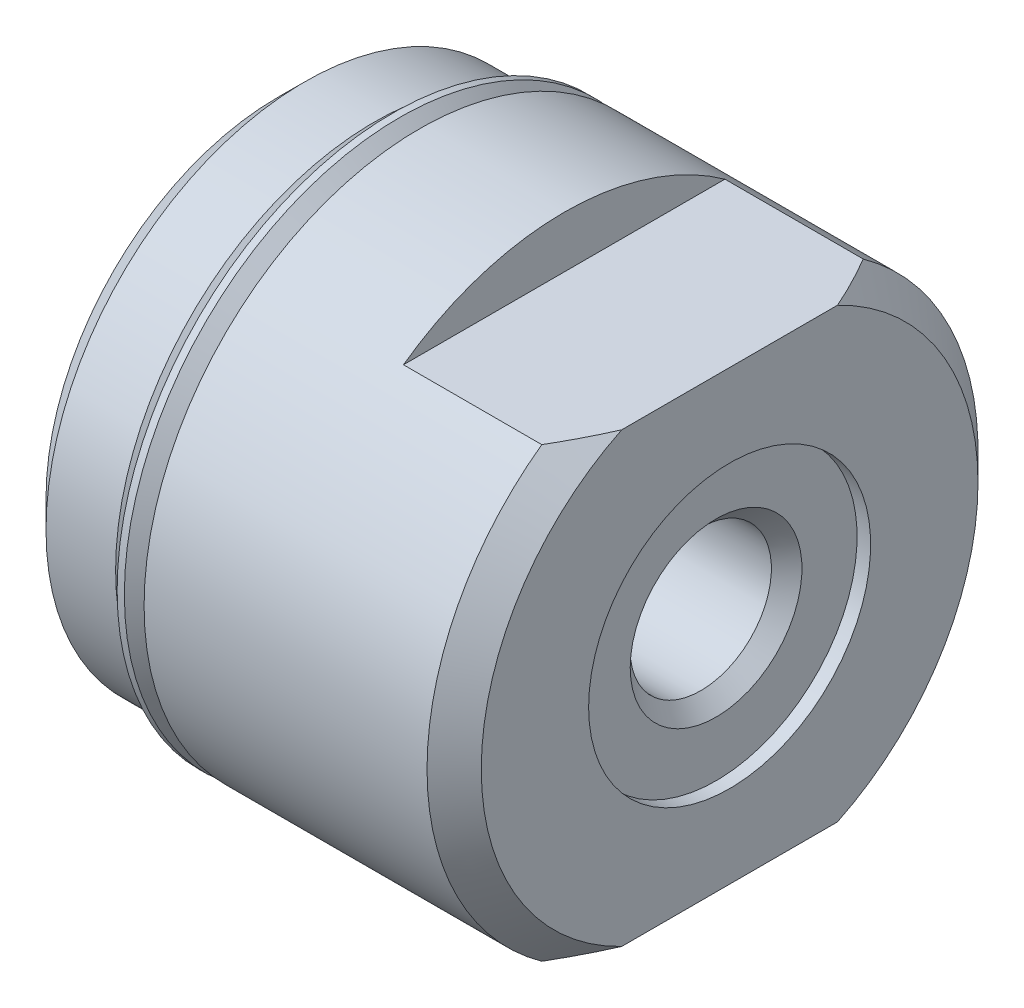
ISO-10303-21;
HEADER;
FILE_DESCRIPTION(('STEP AP214'),'2;1');
FILE_NAME('part.step','',(''),(''),'','','');
FILE_SCHEMA(('AUTOMOTIVE_DESIGN { 1 0 10303 214 1 1 1 1 }'));
ENDSEC;
DATA;
#1=APPLICATION_CONTEXT('core data for automotive mechanical design processes');
#2=APPLICATION_PROTOCOL_DEFINITION('international standard','automotive_design',2000,#1);
#3=PRODUCT_CONTEXT('',#1,'mechanical');
#4=PRODUCT('Part','Part','',(#3));
#5=PRODUCT_RELATED_PRODUCT_CATEGORY('part','',(#4));
#6=PRODUCT_DEFINITION_FORMATION('','',#4);
#7=PRODUCT_DEFINITION_CONTEXT('part definition',#1,'design');
#8=PRODUCT_DEFINITION('design','',#6,#7);
#9=PRODUCT_DEFINITION_SHAPE('','',#8);
#10=(LENGTH_UNIT() NAMED_UNIT(*) SI_UNIT(.MILLI.,.METRE.));
#11=(NAMED_UNIT(*) PLANE_ANGLE_UNIT() SI_UNIT($,.RADIAN.));
#12=(NAMED_UNIT(*) SI_UNIT($,.STERADIAN.) SOLID_ANGLE_UNIT());
#13=UNCERTAINTY_MEASURE_WITH_UNIT(LENGTH_MEASURE(1.E-05),#10,'distance_accuracy_value','');
#14=(GEOMETRIC_REPRESENTATION_CONTEXT(3) GLOBAL_UNCERTAINTY_ASSIGNED_CONTEXT((#13)) GLOBAL_UNIT_ASSIGNED_CONTEXT((#10,
#11,#12)) REPRESENTATION_CONTEXT('',''));
#15=CARTESIAN_POINT('',(0.,0.,0.));
#16=DIRECTION('',(0.,0.,1.));
#17=DIRECTION('',(1.,0.,0.));
#18=AXIS2_PLACEMENT_3D('',#15,#16,#17);
#19=CARTESIAN_POINT('',(12.7,0.,0.));
#20=DIRECTION('',(-1.,0.,0.));
#21=DIRECTION('',(0.,0.,1.));
#22=AXIS2_PLACEMENT_3D('',#19,#20,#21);
#23=CYLINDRICAL_SURFACE('',#22,6.63575);
#24=CARTESIAN_POINT('',(3.3528,0.,0.));
#25=DIRECTION('',(-1.,0.,0.));
#26=DIRECTION('',(0.,0.,1.));
#27=AXIS2_PLACEMENT_3D('',#24,#25,#26);
#28=CIRCLE('',#27,6.63575);
#29=CARTESIAN_POINT('',(3.3528,0.,6.63575));
#30=VERTEX_POINT('',#29);
#31=EDGE_CURVE('E123',#30,#30,#28,.T.);
#32=ORIENTED_EDGE('',*,*,#31,.F.);
#33=EDGE_LOOP('',(#32));
#34=FACE_BOUND('',#33,.T.);
#35=CARTESIAN_POINT('',(3.6703,0.,0.));
#36=DIRECTION('',(1.,0.,0.));
#37=DIRECTION('',(0.,0.,-1.));
#38=AXIS2_PLACEMENT_3D('',#35,#36,#37);
#39=CIRCLE('',#38,6.63575);
#40=CARTESIAN_POINT('',(3.6703,0.,-6.63575));
#41=VERTEX_POINT('',#40);
#42=EDGE_CURVE('E11',#41,#41,#39,.T.);
#43=ORIENTED_EDGE('',*,*,#42,.F.);
#44=EDGE_LOOP('',(#43));
#45=FACE_BOUND('',#44,.T.);
#46=ADVANCED_FACE('F38',(#34,#45),#23,.T.);
#47=CARTESIAN_POINT('',(3.9878,6.63575,0.));
#48=DIRECTION('',(1.,0.,0.));
#49=DIRECTION('',(0.,0.,-1.));
#50=AXIS2_PLACEMENT_3D('',#47,#48,#49);
#51=PLANE('',#50);
#52=CARTESIAN_POINT('',(3.9878,0.,0.));
#53=DIRECTION('',(-1.,0.,0.));
#54=DIRECTION('',(0.,0.,1.));
#55=AXIS2_PLACEMENT_3D('',#52,#53,#54);
#56=CIRCLE('',#55,7.74065);
#57=CARTESIAN_POINT('',(3.9878,0.,7.74065));
#58=VERTEX_POINT('',#57);
#59=EDGE_CURVE('E120',#58,#58,#56,.T.);
#60=ORIENTED_EDGE('',*,*,#59,.T.);
#61=EDGE_LOOP('',(#60));
#62=FACE_BOUND('',#61,.T.);
#63=CARTESIAN_POINT('',(3.9878,0.,0.));
#64=DIRECTION('',(1.,0.,0.));
#65=DIRECTION('',(0.,0.,-1.));
#66=AXIS2_PLACEMENT_3D('',#63,#64,#65);
#67=CIRCLE('',#66,7.1861438079811);
#68=CARTESIAN_POINT('',(3.9878,0.,-7.1861438079811));
#69=VERTEX_POINT('',#68);
#70=EDGE_CURVE('E46',#69,#69,#67,.F.);
#71=ORIENTED_EDGE('',*,*,#70,.F.);
#72=EDGE_LOOP('',(#71));
#73=FACE_BOUND('',#72,.T.);
#74=ADVANCED_FACE('F179',(#62,#73),#51,.F.);
#75=CARTESIAN_POINT('',(12.7,6.97865,0.));
#76=DIRECTION('',(-1.,0.,0.));
#77=DIRECTION('',(0.,0.,1.));
#78=AXIS2_PLACEMENT_3D('',#75,#76,#77);
#79=PLANE('',#78);
#80=CARTESIAN_POINT('',(12.7,0.,0.));
#81=DIRECTION('',(-1.,0.,0.));
#82=DIRECTION('',(0.,0.,1.));
#83=AXIS2_PLACEMENT_3D('',#80,#81,#82);
#84=CIRCLE('',#83,3.9624);
#85=CARTESIAN_POINT('',(12.7,0.,3.9624));
#86=VERTEX_POINT('',#85);
#87=EDGE_CURVE('E219',#86,#86,#84,.T.);
#88=ORIENTED_EDGE('',*,*,#87,.T.);
#89=EDGE_LOOP('',(#88));
#90=FACE_BOUND('',#89,.T.);
#91=DIRECTION('',(0.,0.,1.));
#92=VECTOR('',#91,1.);
#93=CARTESIAN_POINT('',(12.7,6.2865,-15.4813));
#94=LINE('',#93,#92);
#95=CARTESIAN_POINT('',(12.7,6.2865,-3.03009464744915));
#96=VERTEX_POINT('',#95);
#97=CARTESIAN_POINT('',(12.7,6.2865,3.03009464744915));
#98=VERTEX_POINT('',#97);
#99=EDGE_CURVE('E61',#96,#98,#94,.T.);
#100=ORIENTED_EDGE('',*,*,#99,.T.);
#101=CARTESIAN_POINT('',(12.7,0.,0.));
#102=DIRECTION('',(-1.,0.,0.));
#103=DIRECTION('',(0.,0.,1.));
#104=AXIS2_PLACEMENT_3D('',#101,#102,#103);
#105=CIRCLE('',#104,6.97865);
#106=CARTESIAN_POINT('',(12.7,-6.2865,3.03009464744915));
#107=VERTEX_POINT('',#106);
#108=EDGE_CURVE('E107',#107,#98,#105,.T.);
#109=ORIENTED_EDGE('',*,*,#108,.F.);
#110=DIRECTION('',(0.,0.,-1.));
#111=VECTOR('',#110,1.);
#112=CARTESIAN_POINT('',(12.7,-6.2865,15.4813));
#113=LINE('',#112,#111);
#114=CARTESIAN_POINT('',(12.7,-6.2865,-3.03009464744915));
#115=VERTEX_POINT('',#114);
#116=EDGE_CURVE('E53',#107,#115,#113,.T.);
#117=ORIENTED_EDGE('',*,*,#116,.T.);
#118=EDGE_CURVE('E105',#96,#115,#105,.T.);
#119=ORIENTED_EDGE('',*,*,#118,.F.);
#120=EDGE_LOOP('',(#100,#109,#117,#119));
#121=FACE_BOUND('',#120,.T.);
#122=ADVANCED_FACE('F104',(#90,#121),#79,.F.);
#123=CARTESIAN_POINT('',(12.7,0.,0.));
#124=DIRECTION('',(-1.,0.,0.));
#125=DIRECTION('',(0.,0.,1.));
#126=AXIS2_PLACEMENT_3D('',#123,#124,#125);
#127=CYLINDRICAL_SURFACE('',#126,7.74065);
#128=ORIENTED_EDGE('',*,*,#59,.F.);
#129=EDGE_LOOP('',(#128));
#130=FACE_BOUND('',#129,.T.);
#131=DIRECTION('',(-1.,0.,0.));
#132=VECTOR('',#131,1.);
#133=CARTESIAN_POINT('',(12.7,6.2865,-4.51636802890331));
#134=LINE('',#133,#132);
#135=CARTESIAN_POINT('',(11.938,6.2865,-4.51636802890331));
#136=VERTEX_POINT('',#135);
#137=CARTESIAN_POINT('',(8.0518,6.2865,-4.51636802890331));
#138=VERTEX_POINT('',#137);
#139=EDGE_CURVE('E230',#136,#138,#134,.T.);
#140=ORIENTED_EDGE('',*,*,#139,.F.);
#141=CARTESIAN_POINT('',(11.938,0.,0.));
#142=DIRECTION('',(-1.,0.,0.));
#143=DIRECTION('',(0.,0.,1.));
#144=AXIS2_PLACEMENT_3D('',#141,#142,#143);
#145=CIRCLE('',#144,7.74065);
#146=CARTESIAN_POINT('',(11.938,-6.2865,-4.51636802890336));
#147=VERTEX_POINT('',#146);
#148=EDGE_CURVE('E114',#136,#147,#145,.T.);
#149=ORIENTED_EDGE('',*,*,#148,.T.);
#150=DIRECTION('',(-1.,0.,0.));
#151=VECTOR('',#150,1.);
#152=CARTESIAN_POINT('',(12.7,-6.2865,-4.51636802890331));
#153=LINE('',#152,#151);
#154=CARTESIAN_POINT('',(8.0518,-6.2865,-4.51636802890331));
#155=VERTEX_POINT('',#154);
#156=EDGE_CURVE('E93',#155,#147,#153,.F.);
#157=ORIENTED_EDGE('',*,*,#156,.F.);
#158=CARTESIAN_POINT('',(8.0518,0.,0.));
#159=DIRECTION('',(1.,0.,0.));
#160=DIRECTION('',(0.,0.,-1.));
#161=AXIS2_PLACEMENT_3D('',#158,#159,#160);
#162=CIRCLE('',#161,7.74065);
#163=CARTESIAN_POINT('',(8.0518,-6.2865,4.51636802890331));
#164=VERTEX_POINT('',#163);
#165=EDGE_CURVE('E272',#164,#155,#162,.T.);
#166=ORIENTED_EDGE('',*,*,#165,.F.);
#167=DIRECTION('',(-1.,0.,0.));
#168=VECTOR('',#167,1.);
#169=CARTESIAN_POINT('',(12.7,-6.2865,4.51636802890331));
#170=LINE('',#169,#168);
#171=CARTESIAN_POINT('',(11.938,-6.2865,4.51636802890331));
#172=VERTEX_POINT('',#171);
#173=EDGE_CURVE('E233',#172,#164,#170,.T.);
#174=ORIENTED_EDGE('',*,*,#173,.F.);
#175=CARTESIAN_POINT('',(11.938,6.2865,4.51636802890336));
#176=VERTEX_POINT('',#175);
#177=EDGE_CURVE('E111',#172,#176,#145,.T.);
#178=ORIENTED_EDGE('',*,*,#177,.T.);
#179=DIRECTION('',(-1.,0.,0.));
#180=VECTOR('',#179,1.);
#181=CARTESIAN_POINT('',(12.7,6.2865,4.51636802890331));
#182=LINE('',#181,#180);
#183=CARTESIAN_POINT('',(8.0518,6.2865,4.51636802890331));
#184=VERTEX_POINT('',#183);
#185=EDGE_CURVE('E228',#184,#176,#182,.F.);
#186=ORIENTED_EDGE('',*,*,#185,.F.);
#187=EDGE_CURVE('E271',#138,#184,#162,.T.);
#188=ORIENTED_EDGE('',*,*,#187,.F.);
#189=EDGE_LOOP('',(#140,#149,#157,#166,#174,#178,#186,#188));
#190=FACE_BOUND('',#189,.T.);
#191=ADVANCED_FACE('F178',(#130,#190),#127,.T.);
#192=CARTESIAN_POINT('',(12.7,0.,0.));
#193=DIRECTION('',(-1.,0.,0.));
#194=DIRECTION('',(0.,0.,1.));
#195=AXIS2_PLACEMENT_3D('',#192,#193,#194);
#196=CONICAL_SURFACE('',#195,6.97865,0.785398163397449);
#197=CARTESIAN_POINT('',(2.63777496087242,6.2865,15.8389185189255));
#198=CARTESIAN_POINT('',(2.86101367111561,6.2865,15.5987348094419));
#199=CARTESIAN_POINT('',(3.08388626444789,6.2865,15.3582108728465));
#200=CARTESIAN_POINT('',(3.52878491013917,6.2865,14.8763783903599));
#201=CARTESIAN_POINT('',(3.75081095664256,6.2865,14.6350698390628));
#202=CARTESIAN_POINT('',(4.41553903969209,6.2865,13.9097114227827));
#203=CARTESIAN_POINT('',(4.85679434103776,6.2865,13.42433261587));
#204=CARTESIAN_POINT('',(5.73686788697622,6.2865,12.4458535323734));
#205=CARTESIAN_POINT('',(6.17565360373324,6.2865,11.9527239443289));
#206=CARTESIAN_POINT('',(7.04588032765988,6.2865,10.960109554375));
#207=CARTESIAN_POINT('',(7.47732222174153,6.2865,10.4606255328048));
#208=CARTESIAN_POINT('',(8.24328320789912,6.2865,9.55476760319327));
#209=CARTESIAN_POINT('',(8.57972996745497,6.2865,9.15003122621074));
#210=CARTESIAN_POINT('',(9.07733495659606,6.2865,8.53709138478453));
#211=CARTESIAN_POINT('',(9.24204910749507,6.2865,8.33177539625438));
#212=CARTESIAN_POINT('',(9.56861571831644,6.2865,7.91888268212123));
#213=CARTESIAN_POINT('',(9.73046823809724,6.2865,7.71130600395354));
#214=CARTESIAN_POINT('',(10.0505078999345,6.2865,7.29376403848766));
#215=CARTESIAN_POINT('',(10.2086994852572,6.2865,7.08380216376726));
#216=CARTESIAN_POINT('',(10.5208449515217,6.2865,6.66075851759376));
#217=CARTESIAN_POINT('',(10.6747990342863,6.2865,6.44767689547037));
#218=CARTESIAN_POINT('',(10.9773961559004,6.2865,6.01789197733068));
#219=CARTESIAN_POINT('',(11.1260413208857,6.2865,5.80119018334686));
#220=CARTESIAN_POINT('',(11.4167207762761,6.2865,5.36341262584989));
#221=CARTESIAN_POINT('',(11.5587558590299,6.2865,5.14233739113086));
#222=CARTESIAN_POINT('',(11.8261365696979,6.2865,4.70842841454013));
#223=CARTESIAN_POINT('',(11.9519721962542,6.2865,4.49589814454182));
#224=CARTESIAN_POINT('',(12.1942350064502,6.2865,4.06546945018992));
#225=CARTESIAN_POINT('',(12.3106611552723,6.2865,3.84757043883235));
#226=CARTESIAN_POINT('',(12.531415873901,6.2865,3.40579904697156));
#227=CARTESIAN_POINT('',(12.6357499405366,6.2865,3.18192943797168));
#228=CARTESIAN_POINT('',(12.8290044980323,6.2865,2.72759619493044));
#229=CARTESIAN_POINT('',(12.9179290912789,6.2865,2.49713433500514));
#230=CARTESIAN_POINT('',(13.0593258018608,6.2865,2.0797114644568));
#231=CARTESIAN_POINT('',(13.115525607665,6.2865,1.89402067102484));
#232=CARTESIAN_POINT('',(13.2137892398575,6.2865,1.51890595291779));
#233=CARTESIAN_POINT('',(13.2558547800726,6.2865,1.32948248379285));
#234=CARTESIAN_POINT('',(13.3237710829733,6.2865,0.948373517051268));
#235=CARTESIAN_POINT('',(13.3496764927925,6.2865,0.756697900772824));
#236=CARTESIAN_POINT('',(13.3840826326953,6.2865,0.371776828271843));
#237=CARTESIAN_POINT('',(13.3925844814118,6.2865,0.178531473747613));
#238=CARTESIAN_POINT('',(13.3916796915097,6.2865,-0.208553294331633));
#239=CARTESIAN_POINT('',(13.382214017456,6.2865,-0.40239256970999));
#240=CARTESIAN_POINT('',(13.3458206348026,6.2865,-0.788411456101666));
#241=CARTESIAN_POINT('',(13.3188915841601,6.2865,-0.980590938411305));
#242=CARTESIAN_POINT('',(13.2489296240936,6.2865,-1.36257770769597));
#243=CARTESIAN_POINT('',(13.2058462347732,6.2865,-1.55237561086974));
#244=CARTESIAN_POINT('',(13.1055906388605,6.2865,-1.92817258153841));
#245=CARTESIAN_POINT('',(13.0484176323392,6.2865,-2.11417143269508));
#246=CARTESIAN_POINT('',(12.9162279414387,6.2865,-2.49919254783543));
#247=CARTESIAN_POINT('',(12.8400440141665,6.2865,-2.69781045668077));
#248=CARTESIAN_POINT('',(12.6759768875133,6.2865,-3.09016657247723));
#249=CARTESIAN_POINT('',(12.5880902627284,6.2865,-3.28390333088516));
#250=CARTESIAN_POINT('',(12.4027005456422,6.2865,-3.66708634243407));
#251=CARTESIAN_POINT('',(12.3051815468811,6.2865,-3.85652484133555));
#252=CARTESIAN_POINT('',(12.1024817396051,6.2865,-4.23120097427968));
#253=CARTESIAN_POINT('',(11.9973018712103,6.2865,-4.41643912013154));
#254=CARTESIAN_POINT('',(11.7793264488212,6.2865,-4.78557177546877));
#255=CARTESIAN_POINT('',(11.6664505531083,6.2865,-4.96941862115643));
#256=CARTESIAN_POINT('',(11.4354899032036,6.2865,-5.33380344261731));
#257=CARTESIAN_POINT('',(11.3174050338433,6.2865,-5.51434134510602));
#258=CARTESIAN_POINT('',(11.0770707014541,6.2865,-5.87236485736844));
#259=CARTESIAN_POINT('',(10.9548253244935,6.2865,-6.04985321815733));
#260=CARTESIAN_POINT('',(10.7067928944247,6.2865,-6.40232830550328));
#261=CARTESIAN_POINT('',(10.5810058813887,6.2865,-6.57731506033113));
#262=CARTESIAN_POINT('',(10.3015596019265,6.2865,-6.95915535502876));
#263=CARTESIAN_POINT('',(10.14726378039,6.2865,-7.1655424809271));
#264=CARTESIAN_POINT('',(9.83520582476163,6.2865,-7.57568283540061));
#265=CARTESIAN_POINT('',(9.67744357005395,6.2865,-7.77943597193209));
#266=CARTESIAN_POINT('',(9.19985345892673,6.2865,-8.38738844047443));
#267=CARTESIAN_POINT('',(8.87575688292316,6.2865,-8.78823410957629));
#268=CARTESIAN_POINT('',(8.21927481137624,6.2865,-9.5837081036905));
#269=CARTESIAN_POINT('',(7.88688136041657,6.2865,-9.97832981915331));
#270=CARTESIAN_POINT('',(7.21623548297786,6.2865,-10.7625735268203));
#271=CARTESIAN_POINT('',(6.87798288269206,6.2865,-11.1521953701086));
#272=CARTESIAN_POINT('',(6.21801486689102,6.2865,-11.9037324063293));
#273=CARTESIAN_POINT('',(5.89656141003819,6.2865,-12.2658782016514));
#274=CARTESIAN_POINT('',(5.250611067982,6.2865,-12.9874575346389));
#275=CARTESIAN_POINT('',(4.92611411312302,6.2865,-13.3468910098868));
#276=CARTESIAN_POINT('',(4.27541088940934,6.2865,-14.0627867803889));
#277=CARTESIAN_POINT('',(3.94920983286156,6.2865,-14.4192538192509));
#278=CARTESIAN_POINT('',(3.294853462454,6.2865,-15.1303594218634));
#279=CARTESIAN_POINT('',(2.96669824126323,6.2865,-15.4849980708539));
#280=CARTESIAN_POINT('',(2.63777496087242,6.2865,-15.8389185189255));
#281=B_SPLINE_CURVE_WITH_KNOTS('',3,(#197,#198,#199,#200,#201,#202,#203,#204,#205,#206,#207,
#208,#209,#210,#211,#212,#213,#214,#215,#216,#217,#218,#219,#220,#221,#222,#223,#224,#225,#226,
#227,#228,#229,#230,#231,#232,#233,#234,#235,#236,#237,#238,#239,#240,#241,#242,#243,#244,#245,
#246,#247,#248,#249,#250,#251,#252,#253,#254,#255,#256,#257,#258,#259,#260,#261,#262,#263,#264,
#265,#266,#267,#268,#269,#270,#271,#272,#273,#274,#275,#276,#277,#278,#279,#280),.UNSPECIFIED.,
.F.,.F.,(4,2,2,2,2,2,2,2,2,2,2,2,2,2,2,2,2,2,2,2,2,2,2,2,2,2,2,2,2,2,2,2,2,2,2,2,2,2,2,2,2,4),
(0.,0.983723598756834,1.96745398968148,3.9353403539218,5.91554077337164,7.89550032289552,
9.47433022669045,10.2639739652941,11.0536011668588,11.8422135733619,12.6307883547876,
13.4190437002786,14.2072043131384,14.9479853122509,15.6888476690123,16.4293719119086,
17.1696987048645,17.7512582788777,18.3327473113868,18.9122591655444,19.4917337697678,
20.0731156352992,20.654542184732,21.2378009555644,21.8210928481703,22.4588150194381,
23.0967242653209,23.7357051197331,24.3746076919095,25.0217003706933,25.6688073636294,
26.3152961947359,26.96177771405,27.7347935871506,28.5078364003526,30.054096420488,
31.6019007971123,33.1497511669554,34.6024309950037,36.055144151619,37.504716546069,
38.9542207388013),.UNSPECIFIED.);
#282=EDGE_CURVE('E273',#176,#98,#281,.T.);
#283=ORIENTED_EDGE('',*,*,#282,.F.);
#284=ORIENTED_EDGE('',*,*,#177,.F.);
#285=CARTESIAN_POINT('',(2.63777496087242,-6.2865,-15.8389185189255));
#286=CARTESIAN_POINT('',(2.86101367111561,-6.2865,-15.5987348094419));
#287=CARTESIAN_POINT('',(3.08388626444789,-6.2865,-15.3582108728465));
#288=CARTESIAN_POINT('',(3.52878491013917,-6.2865,-14.8763783903599));
#289=CARTESIAN_POINT('',(3.75081095664256,-6.2865,-14.6350698390628));
#290=CARTESIAN_POINT('',(4.41553903969209,-6.2865,-13.9097114227827));
#291=CARTESIAN_POINT('',(4.85679434103776,-6.2865,-13.42433261587));
#292=CARTESIAN_POINT('',(5.73686788697622,-6.2865,-12.4458535323734));
#293=CARTESIAN_POINT('',(6.17565360373324,-6.2865,-11.9527239443289));
#294=CARTESIAN_POINT('',(7.04588032765988,-6.2865,-10.960109554375));
#295=CARTESIAN_POINT('',(7.47732222174153,-6.2865,-10.4606255328048));
#296=CARTESIAN_POINT('',(8.24328320789912,-6.2865,-9.55476760319327));
#297=CARTESIAN_POINT('',(8.57972996745497,-6.2865,-9.15003122621074));
#298=CARTESIAN_POINT('',(9.07733495659606,-6.2865,-8.53709138478453));
#299=CARTESIAN_POINT('',(9.24204910749507,-6.2865,-8.33177539625438));
#300=CARTESIAN_POINT('',(9.56861571831644,-6.2865,-7.91888268212123));
#301=CARTESIAN_POINT('',(9.73046823809724,-6.2865,-7.71130600395354));
#302=CARTESIAN_POINT('',(10.0505078999345,-6.2865,-7.29376403848766));
#303=CARTESIAN_POINT('',(10.2086994852572,-6.2865,-7.08380216376726));
#304=CARTESIAN_POINT('',(10.5208449515217,-6.2865,-6.66075851759376));
#305=CARTESIAN_POINT('',(10.6747990342863,-6.2865,-6.44767689547037));
#306=CARTESIAN_POINT('',(10.9773961559004,-6.2865,-6.01789197733068));
#307=CARTESIAN_POINT('',(11.1260413208857,-6.2865,-5.80119018334686));
#308=CARTESIAN_POINT('',(11.4167207762761,-6.2865,-5.36341262584989));
#309=CARTESIAN_POINT('',(11.5587558590299,-6.2865,-5.14233739113086));
#310=CARTESIAN_POINT('',(11.8261365696979,-6.2865,-4.70842841454013));
#311=CARTESIAN_POINT('',(11.9519721962542,-6.2865,-4.49589814454182));
#312=CARTESIAN_POINT('',(12.1942350064502,-6.2865,-4.06546945018992));
#313=CARTESIAN_POINT('',(12.3106611552723,-6.2865,-3.84757043883235));
#314=CARTESIAN_POINT('',(12.531415873901,-6.2865,-3.40579904697156));
#315=CARTESIAN_POINT('',(12.6357499405366,-6.2865,-3.18192943797168));
#316=CARTESIAN_POINT('',(12.8290044980323,-6.2865,-2.72759619493044));
#317=CARTESIAN_POINT('',(12.9179290912789,-6.2865,-2.49713433500514));
#318=CARTESIAN_POINT('',(13.0593258018608,-6.2865,-2.0797114644568));
#319=CARTESIAN_POINT('',(13.115525607665,-6.2865,-1.89402067102484));
#320=CARTESIAN_POINT('',(13.2137892398575,-6.2865,-1.51890595291779));
#321=CARTESIAN_POINT('',(13.2558547800726,-6.2865,-1.32948248379285));
#322=CARTESIAN_POINT('',(13.3237710829733,-6.2865,-0.948373517051268));
#323=CARTESIAN_POINT('',(13.3496764927925,-6.2865,-0.756697900772824));
#324=CARTESIAN_POINT('',(13.3840826326953,-6.2865,-0.371776828271843));
#325=CARTESIAN_POINT('',(13.3925844814118,-6.2865,-0.178531473747613));
#326=CARTESIAN_POINT('',(13.3916796915097,-6.2865,0.208553294331633));
#327=CARTESIAN_POINT('',(13.382214017456,-6.2865,0.40239256970999));
#328=CARTESIAN_POINT('',(13.3458206348026,-6.2865,0.788411456101666));
#329=CARTESIAN_POINT('',(13.3188915841601,-6.2865,0.980590938411305));
#330=CARTESIAN_POINT('',(13.2489296240936,-6.2865,1.36257770769597));
#331=CARTESIAN_POINT('',(13.2058462347732,-6.2865,1.55237561086974));
#332=CARTESIAN_POINT('',(13.1055906388605,-6.2865,1.92817258153841));
#333=CARTESIAN_POINT('',(13.0484176323392,-6.2865,2.11417143269508));
#334=CARTESIAN_POINT('',(12.9162279414387,-6.2865,2.49919254783543));
#335=CARTESIAN_POINT('',(12.8400440141665,-6.2865,2.69781045668077));
#336=CARTESIAN_POINT('',(12.6759768875133,-6.2865,3.09016657247723));
#337=CARTESIAN_POINT('',(12.5880902627284,-6.2865,3.28390333088516));
#338=CARTESIAN_POINT('',(12.4027005456422,-6.2865,3.66708634243407));
#339=CARTESIAN_POINT('',(12.3051815468811,-6.2865,3.85652484133555));
#340=CARTESIAN_POINT('',(12.1024817396051,-6.2865,4.23120097427968));
#341=CARTESIAN_POINT('',(11.9973018712103,-6.2865,4.41643912013154));
#342=CARTESIAN_POINT('',(11.7793264488212,-6.2865,4.78557177546877));
#343=CARTESIAN_POINT('',(11.6664505531083,-6.2865,4.96941862115643));
#344=CARTESIAN_POINT('',(11.4354899032036,-6.2865,5.33380344261731));
#345=CARTESIAN_POINT('',(11.3174050338433,-6.2865,5.51434134510602));
#346=CARTESIAN_POINT('',(11.0770707014541,-6.2865,5.87236485736844));
#347=CARTESIAN_POINT('',(10.9548253244935,-6.2865,6.04985321815733));
#348=CARTESIAN_POINT('',(10.7067928944247,-6.2865,6.40232830550328));
#349=CARTESIAN_POINT('',(10.5810058813887,-6.2865,6.57731506033113));
#350=CARTESIAN_POINT('',(10.3015596019265,-6.2865,6.95915535502876));
#351=CARTESIAN_POINT('',(10.14726378039,-6.2865,7.1655424809271));
#352=CARTESIAN_POINT('',(9.83520582476163,-6.2865,7.57568283540061));
#353=CARTESIAN_POINT('',(9.67744357005395,-6.2865,7.77943597193209));
#354=CARTESIAN_POINT('',(9.19985345892673,-6.2865,8.38738844047443));
#355=CARTESIAN_POINT('',(8.87575688292316,-6.2865,8.78823410957629));
#356=CARTESIAN_POINT('',(8.21927481137624,-6.2865,9.5837081036905));
#357=CARTESIAN_POINT('',(7.88688136041657,-6.2865,9.97832981915331));
#358=CARTESIAN_POINT('',(7.21623548297786,-6.2865,10.7625735268203));
#359=CARTESIAN_POINT('',(6.87798288269206,-6.2865,11.1521953701086));
#360=CARTESIAN_POINT('',(6.21801486689102,-6.2865,11.9037324063293));
#361=CARTESIAN_POINT('',(5.89656141003819,-6.2865,12.2658782016514));
#362=CARTESIAN_POINT('',(5.250611067982,-6.2865,12.9874575346389));
#363=CARTESIAN_POINT('',(4.92611411312302,-6.2865,13.3468910098868));
#364=CARTESIAN_POINT('',(4.27541088940934,-6.2865,14.0627867803889));
#365=CARTESIAN_POINT('',(3.94920983286156,-6.2865,14.4192538192509));
#366=CARTESIAN_POINT('',(3.294853462454,-6.2865,15.1303594218634));
#367=CARTESIAN_POINT('',(2.96669824126323,-6.2865,15.4849980708539));
#368=CARTESIAN_POINT('',(2.63777496087242,-6.2865,15.8389185189255));
#369=B_SPLINE_CURVE_WITH_KNOTS('',3,(#285,#286,#287,#288,#289,#290,#291,#292,#293,#294,#295,
#296,#297,#298,#299,#300,#301,#302,#303,#304,#305,#306,#307,#308,#309,#310,#311,#312,#313,#314,
#315,#316,#317,#318,#319,#320,#321,#322,#323,#324,#325,#326,#327,#328,#329,#330,#331,#332,#333,
#334,#335,#336,#337,#338,#339,#340,#341,#342,#343,#344,#345,#346,#347,#348,#349,#350,#351,#352,
#353,#354,#355,#356,#357,#358,#359,#360,#361,#362,#363,#364,#365,#366,#367,#368),.UNSPECIFIED.,
.F.,.F.,(4,2,2,2,2,2,2,2,2,2,2,2,2,2,2,2,2,2,2,2,2,2,2,2,2,2,2,2,2,2,2,2,2,2,2,2,2,2,2,2,2,4),
(0.,0.983723598756834,1.96745398968148,3.9353403539218,5.91554077337164,7.89550032289552,
9.47433022669045,10.2639739652941,11.0536011668588,11.8422135733619,12.6307883547876,
13.4190437002786,14.2072043131384,14.9479853122509,15.6888476690123,16.4293719119086,
17.1696987048645,17.7512582788777,18.3327473113868,18.9122591655444,19.4917337697678,
20.0731156352992,20.654542184732,21.2378009555644,21.8210928481703,22.4588150194381,
23.0967242653209,23.7357051197331,24.3746076919095,25.0217003706933,25.6688073636294,
26.3152961947359,26.96177771405,27.7347935871506,28.5078364003526,30.054096420488,
31.6019007971123,33.1497511669554,34.6024309950037,36.055144151619,37.504716546069,
38.9542207388013),.UNSPECIFIED.);
#370=EDGE_CURVE('E99',#107,#172,#369,.T.);
#371=ORIENTED_EDGE('',*,*,#370,.F.);
#372=ORIENTED_EDGE('',*,*,#108,.T.);
#373=EDGE_LOOP('',(#283,#284,#371,#372));
#374=FACE_BOUND('',#373,.T.);
#375=ADVANCED_FACE('F145',(#374),#196,.T.);
#376=EDGE_CURVE('E98',#96,#136,#281,.T.);
#377=ORIENTED_EDGE('',*,*,#376,.F.);
#378=ORIENTED_EDGE('',*,*,#118,.T.);
#379=EDGE_CURVE('E89',#147,#115,#369,.T.);
#380=ORIENTED_EDGE('',*,*,#379,.F.);
#381=ORIENTED_EDGE('',*,*,#148,.F.);
#382=EDGE_LOOP('',(#377,#378,#380,#381));
#383=FACE_BOUND('',#382,.T.);
#384=ADVANCED_FACE('F110',(#383),#196,.T.);
#385=CARTESIAN_POINT('',(0.,0.,0.));
#386=DIRECTION('',(1.,0.,0.));
#387=DIRECTION('',(0.,0.,-1.));
#388=AXIS2_PLACEMENT_3D('',#385,#386,#387);
#389=PLANE('',#388);
#390=CARTESIAN_POINT('',(0.,0.,0.));
#391=DIRECTION('',(-1.,0.,0.));
#392=DIRECTION('',(0.,0.,1.));
#393=AXIS2_PLACEMENT_3D('',#390,#391,#392);
#394=CIRCLE('',#393,6.50875);
#395=CARTESIAN_POINT('',(0.,0.,6.50875));
#396=VERTEX_POINT('',#395);
#397=EDGE_CURVE('E132',#396,#396,#394,.T.);
#398=ORIENTED_EDGE('',*,*,#397,.T.);
#399=EDGE_LOOP('',(#398));
#400=FACE_BOUND('',#399,.T.);
#401=CARTESIAN_POINT('',(0.,0.,0.));
#402=DIRECTION('',(-1.,0.,0.));
#403=DIRECTION('',(0.,0.,1.));
#404=AXIS2_PLACEMENT_3D('',#401,#402,#403);
#405=CIRCLE('',#404,1.98374);
#406=CARTESIAN_POINT('',(0.,0.,1.98374));
#407=VERTEX_POINT('',#406);
#408=EDGE_CURVE('E218',#407,#407,#405,.T.);
#409=ORIENTED_EDGE('',*,*,#408,.F.);
#410=EDGE_LOOP('',(#409));
#411=FACE_BOUND('',#410,.T.);
#412=ADVANCED_FACE('F40',(#400,#411),#389,.F.);
#413=CARTESIAN_POINT('',(12.319,0.,0.));
#414=DIRECTION('',(1.,0.,0.));
#415=DIRECTION('',(0.,0.,-1.));
#416=AXIS2_PLACEMENT_3D('',#413,#414,#415);
#417=PLANE('',#416);
#418=CARTESIAN_POINT('',(12.319,0.,0.));
#419=DIRECTION('',(-1.,0.,0.));
#420=DIRECTION('',(0.,0.,1.));
#421=AXIS2_PLACEMENT_3D('',#418,#419,#420);
#422=CIRCLE('',#421,3.9624);
#423=CARTESIAN_POINT('',(12.319,0.,3.9624));
#424=VERTEX_POINT('',#423);
#425=EDGE_CURVE('E116',#424,#424,#422,.T.);
#426=ORIENTED_EDGE('',*,*,#425,.F.);
#427=EDGE_LOOP('',(#426));
#428=FACE_BOUND('',#427,.T.);
#429=CARTESIAN_POINT('',(12.319,0.,0.));
#430=DIRECTION('',(-1.,0.,0.));
#431=DIRECTION('',(0.,0.,1.));
#432=AXIS2_PLACEMENT_3D('',#429,#430,#431);
#433=CIRCLE('',#432,2.413);
#434=CARTESIAN_POINT('',(12.319,0.,2.413));
#435=VERTEX_POINT('',#434);
#436=EDGE_CURVE('E223',#435,#435,#433,.T.);
#437=ORIENTED_EDGE('',*,*,#436,.T.);
#438=EDGE_LOOP('',(#437));
#439=FACE_BOUND('',#438,.T.);
#440=ADVANCED_FACE('F173',(#428,#439),#417,.T.);
#441=CARTESIAN_POINT('',(0.762000000000001,0.,0.));
#442=DIRECTION('',(1.,0.,0.));
#443=DIRECTION('',(0.,0.,-1.));
#444=AXIS2_PLACEMENT_3D('',#441,#442,#443);
#445=CONICAL_SURFACE('',#444,7.27075,0.785398163397448);
#446=ORIENTED_EDGE('',*,*,#397,.F.);
#447=EDGE_LOOP('',(#446));
#448=FACE_BOUND('',#447,.T.);
#449=CARTESIAN_POINT('',(0.762000000000001,0.,0.));
#450=DIRECTION('',(-1.,0.,0.));
#451=DIRECTION('',(0.,0.,1.));
#452=AXIS2_PLACEMENT_3D('',#449,#450,#451);
#453=CIRCLE('',#452,7.27075);
#454=CARTESIAN_POINT('',(0.762000000000001,0.,7.27075));
#455=VERTEX_POINT('',#454);
#456=EDGE_CURVE('E129',#455,#455,#453,.T.);
#457=ORIENTED_EDGE('',*,*,#456,.T.);
#458=EDGE_LOOP('',(#457));
#459=FACE_BOUND('',#458,.T.);
#460=ADVANCED_FACE('F175',(#448,#459),#445,.T.);
#461=CARTESIAN_POINT('',(12.7,0.,0.));
#462=DIRECTION('',(-1.,0.,0.));
#463=DIRECTION('',(0.,0.,1.));
#464=AXIS2_PLACEMENT_3D('',#461,#462,#463);
#465=CYLINDRICAL_SURFACE('',#464,7.27075);
#466=ORIENTED_EDGE('',*,*,#456,.F.);
#467=EDGE_LOOP('',(#466));
#468=FACE_BOUND('',#467,.T.);
#469=CARTESIAN_POINT('',(2.7178,0.,0.));
#470=DIRECTION('',(-1.,0.,0.));
#471=DIRECTION('',(0.,0.,1.));
#472=AXIS2_PLACEMENT_3D('',#469,#470,#471);
#473=CIRCLE('',#472,7.27075);
#474=CARTESIAN_POINT('',(2.7178,0.,7.27075));
#475=VERTEX_POINT('',#474);
#476=EDGE_CURVE('E126',#475,#475,#473,.T.);
#477=ORIENTED_EDGE('',*,*,#476,.T.);
#478=EDGE_LOOP('',(#477));
#479=FACE_BOUND('',#478,.T.);
#480=ADVANCED_FACE('F199',(#468,#479),#465,.T.);
#481=CARTESIAN_POINT('',(3.3528,0.,0.));
#482=DIRECTION('',(-1.,0.,0.));
#483=DIRECTION('',(0.,0.,1.));
#484=AXIS2_PLACEMENT_3D('',#481,#482,#483);
#485=CONICAL_SURFACE('',#484,6.63575,0.785398163397448);
#486=ORIENTED_EDGE('',*,*,#476,.F.);
#487=EDGE_LOOP('',(#486));
#488=FACE_BOUND('',#487,.T.);
#489=ORIENTED_EDGE('',*,*,#31,.T.);
#490=EDGE_LOOP('',(#489));
#491=FACE_BOUND('',#490,.T.);
#492=ADVANCED_FACE('F171',(#488,#491),#485,.T.);
#493=CARTESIAN_POINT('',(12.7,0.,0.));
#494=DIRECTION('',(-1.,0.,0.));
#495=DIRECTION('',(0.,0.,1.));
#496=AXIS2_PLACEMENT_3D('',#493,#494,#495);
#497=CYLINDRICAL_SURFACE('',#496,3.9624);
#498=ORIENTED_EDGE('',*,*,#425,.T.);
#499=EDGE_LOOP('',(#498));
#500=FACE_BOUND('',#499,.T.);
#501=ORIENTED_EDGE('',*,*,#87,.F.);
#502=EDGE_LOOP('',(#501));
#503=FACE_BOUND('',#502,.T.);
#504=ADVANCED_FACE('F167',(#500,#503),#497,.F.);
#505=CARTESIAN_POINT('',(12.319,0.,0.));
#506=DIRECTION('',(-1.,0.,0.));
#507=DIRECTION('',(0.,0.,1.));
#508=AXIS2_PLACEMENT_3D('',#505,#506,#507);
#509=CYLINDRICAL_SURFACE('',#508,1.98374);
#510=ORIENTED_EDGE('',*,*,#408,.T.);
#511=EDGE_LOOP('',(#510));
#512=FACE_BOUND('',#511,.T.);
#513=CARTESIAN_POINT('',(11.88974,0.,0.));
#514=DIRECTION('',(-1.,0.,0.));
#515=DIRECTION('',(0.,0.,1.));
#516=AXIS2_PLACEMENT_3D('',#513,#514,#515);
#517=CIRCLE('',#516,1.98374);
#518=CARTESIAN_POINT('',(11.88974,0.,1.98374));
#519=VERTEX_POINT('',#518);
#520=EDGE_CURVE('E220',#519,#519,#517,.T.);
#521=ORIENTED_EDGE('',*,*,#520,.F.);
#522=EDGE_LOOP('',(#521));
#523=FACE_BOUND('',#522,.T.);
#524=ADVANCED_FACE('F163',(#512,#523),#509,.F.);
#525=CARTESIAN_POINT('',(12.319,0.,0.));
#526=DIRECTION('',(1.,0.,0.));
#527=DIRECTION('',(0.,0.,-1.));
#528=AXIS2_PLACEMENT_3D('',#525,#526,#527);
#529=CONICAL_SURFACE('',#528,2.413,0.785398163397445);
#530=ORIENTED_EDGE('',*,*,#520,.T.);
#531=EDGE_LOOP('',(#530));
#532=FACE_BOUND('',#531,.T.);
#533=ORIENTED_EDGE('',*,*,#436,.F.);
#534=EDGE_LOOP('',(#533));
#535=FACE_BOUND('',#534,.T.);
#536=ADVANCED_FACE('F153',(#532,#535),#529,.F.);
#537=CARTESIAN_POINT('',(8.0518,-6.2865,15.4813));
#538=DIRECTION('',(0.,-1.,0.));
#539=DIRECTION('',(0.,0.,-1.));
#540=AXIS2_PLACEMENT_3D('',#537,#538,#539);
#541=PLANE('',#540);
#542=ORIENTED_EDGE('',*,*,#156,.T.);
#543=ORIENTED_EDGE('',*,*,#379,.T.);
#544=ORIENTED_EDGE('',*,*,#116,.F.);
#545=ORIENTED_EDGE('',*,*,#370,.T.);
#546=ORIENTED_EDGE('',*,*,#173,.T.);
#547=DIRECTION('',(0.,0.,-1.));
#548=VECTOR('',#547,1.);
#549=CARTESIAN_POINT('',(8.0518,-6.2865,15.4813));
#550=LINE('',#549,#548);
#551=EDGE_CURVE('E236',#164,#155,#550,.T.);
#552=ORIENTED_EDGE('',*,*,#551,.T.);
#553=EDGE_LOOP('',(#542,#543,#544,#545,#546,#552));
#554=FACE_BOUND('',#553,.T.);
#555=ADVANCED_FACE('F90',(#554),#541,.T.);
#556=CARTESIAN_POINT('',(8.0518,0.,0.));
#557=DIRECTION('',(1.,0.,0.));
#558=DIRECTION('',(0.,0.,-1.));
#559=AXIS2_PLACEMENT_3D('',#556,#557,#558);
#560=PLANE('',#559);
#561=ORIENTED_EDGE('',*,*,#165,.T.);
#562=ORIENTED_EDGE('',*,*,#551,.F.);
#563=EDGE_LOOP('',(#561,#562));
#564=FACE_BOUND('',#563,.T.);
#565=ADVANCED_FACE('F152',(#564),#560,.T.);
#566=ORIENTED_EDGE('',*,*,#187,.T.);
#567=DIRECTION('',(0.,0.,1.));
#568=VECTOR('',#567,1.);
#569=CARTESIAN_POINT('',(8.0518,6.2865,-15.4813));
#570=LINE('',#569,#568);
#571=EDGE_CURVE('E235',#138,#184,#570,.T.);
#572=ORIENTED_EDGE('',*,*,#571,.F.);
#573=EDGE_LOOP('',(#566,#572));
#574=FACE_BOUND('',#573,.T.);
#575=ADVANCED_FACE('F157',(#574),#560,.T.);
#576=CARTESIAN_POINT('',(8.0518,6.2865,-15.4813));
#577=DIRECTION('',(0.,1.,0.));
#578=DIRECTION('',(0.,0.,1.));
#579=AXIS2_PLACEMENT_3D('',#576,#577,#578);
#580=PLANE('',#579);
#581=ORIENTED_EDGE('',*,*,#185,.T.);
#582=ORIENTED_EDGE('',*,*,#282,.T.);
#583=ORIENTED_EDGE('',*,*,#99,.F.);
#584=ORIENTED_EDGE('',*,*,#376,.T.);
#585=ORIENTED_EDGE('',*,*,#139,.T.);
#586=ORIENTED_EDGE('',*,*,#571,.T.);
#587=EDGE_LOOP('',(#581,#582,#583,#584,#585,#586));
#588=FACE_BOUND('',#587,.T.);
#589=ADVANCED_FACE('F154',(#588),#580,.T.);
#590=CARTESIAN_POINT('',(3.9878,0.,0.));
#591=DIRECTION('',(-1.,0.,0.));
#592=DIRECTION('',(0.,0.,1.));
#593=AXIS2_PLACEMENT_3D('',#590,#591,#592);
#594=CYLINDRICAL_SURFACE('',#593,7.74065);
#595=CARTESIAN_POINT('',(3.2300938079811,0.,0.));
#596=DIRECTION('',(-1.,0.,0.));
#597=DIRECTION('',(0.,0.,1.));
#598=AXIS2_PLACEMENT_3D('',#595,#596,#597);
#599=CIRCLE('',#598,7.74065);
#600=CARTESIAN_POINT('',(3.2300938079811,0.,7.74065));
#601=VERTEX_POINT('',#600);
#602=EDGE_CURVE('E252',#601,#601,#599,.T.);
#603=ORIENTED_EDGE('',*,*,#602,.F.);
#604=EDGE_LOOP('',(#603));
#605=FACE_BOUND('',#604,.T.);
#606=CARTESIAN_POINT('',(3.4332938079811,0.,0.));
#607=DIRECTION('',(-1.,0.,0.));
#608=DIRECTION('',(0.,0.,1.));
#609=AXIS2_PLACEMENT_3D('',#606,#607,#608);
#610=CIRCLE('',#609,7.74065);
#611=CARTESIAN_POINT('',(3.4332938079811,0.,7.74065));
#612=VERTEX_POINT('',#611);
#613=EDGE_CURVE('E108',#612,#612,#610,.T.);
#614=ORIENTED_EDGE('',*,*,#613,.T.);
#615=EDGE_LOOP('',(#614));
#616=FACE_BOUND('',#615,.T.);
#617=ADVANCED_FACE('F258',(#605,#616),#594,.T.);
#618=CARTESIAN_POINT('',(3.9878,0.,0.));
#619=DIRECTION('',(-1.,0.,0.));
#620=DIRECTION('',(0.,0.,1.));
#621=AXIS2_PLACEMENT_3D('',#618,#619,#620);
#622=CONICAL_SURFACE('',#621,7.1861438079811,0.785398163397449);
#623=ORIENTED_EDGE('',*,*,#613,.F.);
#624=EDGE_LOOP('',(#623));
#625=FACE_BOUND('',#624,.T.);
#626=ORIENTED_EDGE('',*,*,#70,.T.);
#627=EDGE_LOOP('',(#626));
#628=FACE_BOUND('',#627,.T.);
#629=ADVANCED_FACE('F261',(#625,#628),#622,.T.);
#630=CARTESIAN_POINT('',(3.8707602448428,0.,0.));
#631=DIRECTION('',(1.,0.,0.));
#632=DIRECTION('',(0.,0.,-1.));
#633=AXIS2_PLACEMENT_3D('',#630,#631,#632);
#634=CONICAL_SURFACE('',#633,6.8362102448428,0.785398163397448);
#635=ORIENTED_EDGE('',*,*,#42,.T.);
#636=EDGE_LOOP('',(#635));
#637=FACE_BOUND('',#636,.T.);
#638=CARTESIAN_POINT('',(3.8707602448428,0.,0.));
#639=DIRECTION('',(-1.,0.,0.));
#640=DIRECTION('',(0.,0.,1.));
#641=AXIS2_PLACEMENT_3D('',#638,#639,#640);
#642=CIRCLE('',#641,6.8362102448428);
#643=CARTESIAN_POINT('',(3.8707602448428,0.,6.8362102448428));
#644=VERTEX_POINT('',#643);
#645=EDGE_CURVE('E243',#644,#644,#642,.T.);
#646=ORIENTED_EDGE('',*,*,#645,.T.);
#647=EDGE_LOOP('',(#646));
#648=FACE_BOUND('',#647,.T.);
#649=ADVANCED_FACE('F266',(#637,#648),#634,.T.);
#650=CARTESIAN_POINT('',(3.78095768363218,0.,0.));
#651=DIRECTION('',(-1.,0.,0.));
#652=DIRECTION('',(0.,0.,1.));
#653=AXIS2_PLACEMENT_3D('',#650,#651,#652);
#654=TOROIDAL_SURFACE('',#653,6.92601280605345,0.126999999999921);
#655=ORIENTED_EDGE('',*,*,#645,.F.);
#656=EDGE_LOOP('',(#655));
#657=FACE_BOUND('',#656,.T.);
#658=CARTESIAN_POINT('',(3.8707602448428,0.,0.));
#659=DIRECTION('',(-1.,0.,0.));
#660=DIRECTION('',(0.,0.,1.));
#661=AXIS2_PLACEMENT_3D('',#658,#659,#660);
#662=CIRCLE('',#661,7.0158153672641);
#663=CARTESIAN_POINT('',(3.8707602448428,0.,7.0158153672641));
#664=VERTEX_POINT('',#663);
#665=EDGE_CURVE('E246',#664,#664,#662,.T.);
#666=ORIENTED_EDGE('',*,*,#665,.T.);
#667=EDGE_LOOP('',(#666));
#668=FACE_BOUND('',#667,.T.);
#669=ADVANCED_FACE('F317',(#657,#668),#654,.F.);
#670=CARTESIAN_POINT('',(3.2300938079811,0.,0.));
#671=DIRECTION('',(-1.,0.,0.));
#672=DIRECTION('',(0.,0.,1.));
#673=AXIS2_PLACEMENT_3D('',#670,#671,#672);
#674=CONICAL_SURFACE('',#673,7.6564818041258,0.785398163397448);
#675=ORIENTED_EDGE('',*,*,#665,.F.);
#676=EDGE_LOOP('',(#675));
#677=FACE_BOUND('',#676,.T.);
#678=CARTESIAN_POINT('',(3.2300938079811,0.,0.));
#679=DIRECTION('',(-1.,0.,0.));
#680=DIRECTION('',(0.,0.,1.));
#681=AXIS2_PLACEMENT_3D('',#678,#679,#680);
#682=CIRCLE('',#681,7.6564818041258);
#683=CARTESIAN_POINT('',(3.2300938079811,0.,7.6564818041258));
#684=VERTEX_POINT('',#683);
#685=EDGE_CURVE('E249',#684,#684,#682,.T.);
#686=ORIENTED_EDGE('',*,*,#685,.T.);
#687=EDGE_LOOP('',(#686));
#688=FACE_BOUND('',#687,.T.);
#689=ADVANCED_FACE('F324',(#677,#688),#674,.F.);
#690=CARTESIAN_POINT('',(3.2300938079811,7.74065,0.));
#691=DIRECTION('',(1.,0.,0.));
#692=DIRECTION('',(0.,0.,-1.));
#693=AXIS2_PLACEMENT_3D('',#690,#691,#692);
#694=PLANE('',#693);
#695=ORIENTED_EDGE('',*,*,#685,.F.);
#696=EDGE_LOOP('',(#695));
#697=FACE_BOUND('',#696,.T.);
#698=ORIENTED_EDGE('',*,*,#602,.T.);
#699=EDGE_LOOP('',(#698));
#700=FACE_BOUND('',#699,.T.);
#701=ADVANCED_FACE('F256',(#697,#700),#694,.F.);
#702=CLOSED_SHELL('',(#46,#74,#122,#191,#375,#384,#412,#440,#460,#480,#492,#504,#524,#536,#555,
#565,#575,#589,#617,#629,#649,#669,#689,#701));
#703=MANIFOLD_SOLID_BREP('B2',#702);
#704=ADVANCED_BREP_SHAPE_REPRESENTATION('',(#18,#703),#14);
#705=SHAPE_DEFINITION_REPRESENTATION(#9,#704);
ENDSEC;
END-ISO-10303-21;
